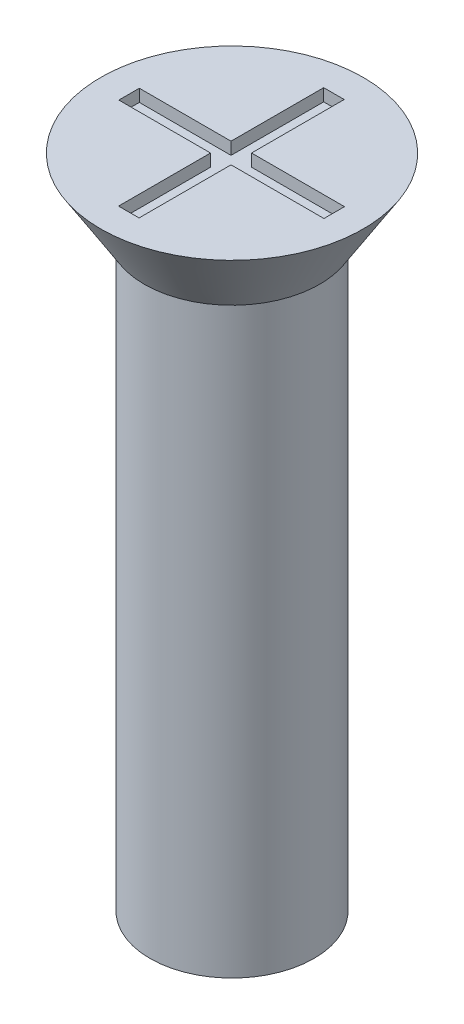
ISO-10303-21;
HEADER;
FILE_DESCRIPTION(('STEP AP214'),'2;1');
FILE_NAME('part.step','',(''),(''),'','','');
FILE_SCHEMA(('AUTOMOTIVE_DESIGN { 1 0 10303 214 1 1 1 1 }'));
ENDSEC;
DATA;
#1=APPLICATION_CONTEXT('core data for automotive mechanical design processes');
#2=APPLICATION_PROTOCOL_DEFINITION('international standard','automotive_design',2000,#1);
#3=PRODUCT_CONTEXT('',#1,'mechanical');
#4=PRODUCT('Part','Part','',(#3));
#5=PRODUCT_RELATED_PRODUCT_CATEGORY('part','',(#4));
#6=PRODUCT_DEFINITION_FORMATION('','',#4);
#7=PRODUCT_DEFINITION_CONTEXT('part definition',#1,'design');
#8=PRODUCT_DEFINITION('design','',#6,#7);
#9=PRODUCT_DEFINITION_SHAPE('','',#8);
#10=(LENGTH_UNIT() NAMED_UNIT(*) SI_UNIT(.MILLI.,.METRE.));
#11=(NAMED_UNIT(*) PLANE_ANGLE_UNIT() SI_UNIT($,.RADIAN.));
#12=(NAMED_UNIT(*) SI_UNIT($,.STERADIAN.) SOLID_ANGLE_UNIT());
#13=UNCERTAINTY_MEASURE_WITH_UNIT(LENGTH_MEASURE(1.E-05),#10,'distance_accuracy_value','');
#14=(GEOMETRIC_REPRESENTATION_CONTEXT(3) GLOBAL_UNCERTAINTY_ASSIGNED_CONTEXT((#13)) GLOBAL_UNIT_ASSIGNED_CONTEXT((#10,
#11,#12)) REPRESENTATION_CONTEXT('',''));
#15=CARTESIAN_POINT('',(0.,0.,0.));
#16=DIRECTION('',(0.,0.,1.));
#17=DIRECTION('',(1.,0.,0.));
#18=AXIS2_PLACEMENT_3D('',#15,#16,#17);
#19=CARTESIAN_POINT('',(0.,16.,0.));
#20=DIRECTION('',(0.,1.,0.));
#21=DIRECTION('',(0.,0.,1.));
#22=AXIS2_PLACEMENT_3D('',#19,#20,#21);
#23=PLANE('',#22);
#24=CARTESIAN_POINT('',(0.,16.,0.));
#25=DIRECTION('',(0.,1.,0.));
#26=DIRECTION('',(0.,0.,1.));
#27=AXIS2_PLACEMENT_3D('',#24,#25,#26);
#28=CIRCLE('',#27,3.2);
#29=CARTESIAN_POINT('',(0.,16.,3.2));
#30=VERTEX_POINT('',#29);
#31=EDGE_CURVE('E192',#30,#30,#28,.T.);
#32=ORIENTED_EDGE('',*,*,#31,.T.);
#33=EDGE_LOOP('',(#32));
#34=FACE_BOUND('',#33,.T.);
#35=DIRECTION('',(1.,0.,0.));
#36=VECTOR('',#35,1.);
#37=CARTESIAN_POINT('',(0.,16.,-2.5));
#38=LINE('',#37,#36);
#39=CARTESIAN_POINT('',(-0.265272843023468,16.,-2.5));
#40=VERTEX_POINT('',#39);
#41=CARTESIAN_POINT('',(0.234727156976532,16.,-2.5));
#42=VERTEX_POINT('',#41);
#43=EDGE_CURVE('E161',#40,#42,#38,.T.);
#44=ORIENTED_EDGE('',*,*,#43,.T.);
#45=DIRECTION('',(0.,0.,1.));
#46=VECTOR('',#45,1.);
#47=CARTESIAN_POINT('',(0.234727156976532,16.,0.));
#48=LINE('',#47,#46);
#49=CARTESIAN_POINT('',(0.234727156976532,16.,-0.241621514992573));
#50=VERTEX_POINT('',#49);
#51=EDGE_CURVE('E48',#42,#50,#48,.T.);
#52=ORIENTED_EDGE('',*,*,#51,.T.);
#53=DIRECTION('',(1.,0.,0.));
#54=VECTOR('',#53,1.);
#55=CARTESIAN_POINT('',(0.,16.,-0.241621514992573));
#56=LINE('',#55,#54);
#57=CARTESIAN_POINT('',(2.5,16.,-0.241621514992573));
#58=VERTEX_POINT('',#57);
#59=EDGE_CURVE('E98',#50,#58,#56,.T.);
#60=ORIENTED_EDGE('',*,*,#59,.T.);
#61=DIRECTION('',(0.,0.,1.));
#62=VECTOR('',#61,1.);
#63=CARTESIAN_POINT('',(2.5,16.,0.));
#64=LINE('',#63,#62);
#65=CARTESIAN_POINT('',(2.5,16.,0.258378485007427));
#66=VERTEX_POINT('',#65);
#67=EDGE_CURVE('E186',#58,#66,#64,.T.);
#68=ORIENTED_EDGE('',*,*,#67,.T.);
#69=DIRECTION('',(1.,0.,0.));
#70=VECTOR('',#69,1.);
#71=CARTESIAN_POINT('',(0.,16.,0.258378485007427));
#72=LINE('',#71,#70);
#73=CARTESIAN_POINT('',(0.234727156976532,16.,0.258378485007427));
#74=VERTEX_POINT('',#73);
#75=EDGE_CURVE('E145',#74,#66,#72,.T.);
#76=ORIENTED_EDGE('',*,*,#75,.F.);
#77=DIRECTION('',(0.,0.,1.));
#78=VECTOR('',#77,1.);
#79=CARTESIAN_POINT('',(0.234727156976532,16.,0.));
#80=LINE('',#79,#78);
#81=CARTESIAN_POINT('',(0.234727156976533,16.,2.5));
#82=VERTEX_POINT('',#81);
#83=EDGE_CURVE('E182',#74,#82,#80,.T.);
#84=ORIENTED_EDGE('',*,*,#83,.T.);
#85=DIRECTION('',(1.,0.,0.));
#86=VECTOR('',#85,1.);
#87=CARTESIAN_POINT('',(0.,16.,2.5));
#88=LINE('',#87,#86);
#89=CARTESIAN_POINT('',(-0.265272843023467,16.,2.5));
#90=VERTEX_POINT('',#89);
#91=EDGE_CURVE('E179',#90,#82,#88,.T.);
#92=ORIENTED_EDGE('',*,*,#91,.F.);
#93=DIRECTION('',(0.,0.,1.));
#94=VECTOR('',#93,1.);
#95=CARTESIAN_POINT('',(-0.265272843023468,16.,0.));
#96=LINE('',#95,#94);
#97=CARTESIAN_POINT('',(-0.265272843023468,16.,0.258378485007427));
#98=VERTEX_POINT('',#97);
#99=EDGE_CURVE('E176',#98,#90,#96,.T.);
#100=ORIENTED_EDGE('',*,*,#99,.F.);
#101=DIRECTION('',(1.,0.,0.));
#102=VECTOR('',#101,1.);
#103=CARTESIAN_POINT('',(0.,16.,0.258378485007427));
#104=LINE('',#103,#102);
#105=CARTESIAN_POINT('',(-2.5,16.,0.258378485007427));
#106=VERTEX_POINT('',#105);
#107=EDGE_CURVE('E173',#106,#98,#104,.T.);
#108=ORIENTED_EDGE('',*,*,#107,.F.);
#109=DIRECTION('',(0.,0.,1.));
#110=VECTOR('',#109,1.);
#111=CARTESIAN_POINT('',(-2.5,16.,0.));
#112=LINE('',#111,#110);
#113=CARTESIAN_POINT('',(-2.5,16.,-0.241621514992573));
#114=VERTEX_POINT('',#113);
#115=EDGE_CURVE('E170',#114,#106,#112,.T.);
#116=ORIENTED_EDGE('',*,*,#115,.F.);
#117=DIRECTION('',(1.,0.,0.));
#118=VECTOR('',#117,1.);
#119=CARTESIAN_POINT('',(0.,16.,-0.241621514992573));
#120=LINE('',#119,#118);
#121=CARTESIAN_POINT('',(-0.265272843023468,16.,-0.241621514992573));
#122=VERTEX_POINT('',#121);
#123=EDGE_CURVE('E167',#114,#122,#120,.T.);
#124=ORIENTED_EDGE('',*,*,#123,.T.);
#125=DIRECTION('',(0.,0.,1.));
#126=VECTOR('',#125,1.);
#127=CARTESIAN_POINT('',(-0.265272843023468,16.,0.));
#128=LINE('',#127,#126);
#129=EDGE_CURVE('E164',#40,#122,#128,.T.);
#130=ORIENTED_EDGE('',*,*,#129,.F.);
#131=EDGE_LOOP('',(#44,#52,#60,#68,#76,#84,#92,#100,#108,#116,#124,#130));
#132=FACE_BOUND('',#131,.T.);
#133=ADVANCED_FACE('F33',(#34,#132),#23,.T.);
#134=CARTESIAN_POINT('',(0.,16.,0.));
#135=DIRECTION('',(0.,-1.,0.));
#136=DIRECTION('',(0.,0.,-1.));
#137=AXIS2_PLACEMENT_3D('',#134,#135,#136);
#138=CYLINDRICAL_SURFACE('',#137,2.);
#139=CARTESIAN_POINT('',(0.,0.,0.));
#140=DIRECTION('',(0.,1.,0.));
#141=DIRECTION('',(0.,0.,1.));
#142=AXIS2_PLACEMENT_3D('',#139,#140,#141);
#143=CIRCLE('',#142,2.);
#144=CARTESIAN_POINT('',(0.,0.,2.));
#145=VERTEX_POINT('',#144);
#146=EDGE_CURVE('E41',#145,#145,#143,.T.);
#147=ORIENTED_EDGE('',*,*,#146,.T.);
#148=EDGE_LOOP('',(#147));
#149=FACE_BOUND('',#148,.T.);
#150=CARTESIAN_POINT('',(0.,14.3,0.));
#151=DIRECTION('',(0.,1.,0.));
#152=DIRECTION('',(0.,0.,1.));
#153=AXIS2_PLACEMENT_3D('',#150,#151,#152);
#154=CIRCLE('',#153,2.);
#155=CARTESIAN_POINT('',(0.,14.3,2.));
#156=VERTEX_POINT('',#155);
#157=EDGE_CURVE('E11',#156,#156,#154,.T.);
#158=ORIENTED_EDGE('',*,*,#157,.F.);
#159=EDGE_LOOP('',(#158));
#160=FACE_BOUND('',#159,.T.);
#161=ADVANCED_FACE('F35',(#149,#160),#138,.T.);
#162=CARTESIAN_POINT('',(0.,0.,0.));
#163=DIRECTION('',(0.,1.,0.));
#164=DIRECTION('',(0.,0.,1.));
#165=AXIS2_PLACEMENT_3D('',#162,#163,#164);
#166=PLANE('',#165);
#167=ORIENTED_EDGE('',*,*,#146,.F.);
#168=EDGE_LOOP('',(#167));
#169=FACE_BOUND('',#168,.T.);
#170=ADVANCED_FACE('F219',(#169),#166,.F.);
#171=CARTESIAN_POINT('',(0.,16.,0.));
#172=DIRECTION('',(0.,1.,0.));
#173=DIRECTION('',(0.,0.,1.));
#174=AXIS2_PLACEMENT_3D('',#171,#172,#173);
#175=CONICAL_SURFACE('',#174,3.2,0.558505360638187);
#176=CARTESIAN_POINT('',(0.,14.3,0.));
#177=DIRECTION('',(0.,1.,0.));
#178=DIRECTION('',(0.,0.,1.));
#179=AXIS2_PLACEMENT_3D('',#176,#177,#178);
#180=CIRCLE('',#179,2.13772210175414);
#181=CARTESIAN_POINT('',(0.,14.3,2.13772210175414));
#182=VERTEX_POINT('',#181);
#183=EDGE_CURVE('E212',#182,#182,#180,.T.);
#184=ORIENTED_EDGE('',*,*,#183,.T.);
#185=EDGE_LOOP('',(#184));
#186=FACE_BOUND('',#185,.T.);
#187=ORIENTED_EDGE('',*,*,#31,.F.);
#188=EDGE_LOOP('',(#187));
#189=FACE_BOUND('',#188,.T.);
#190=ADVANCED_FACE('F221',(#186,#189),#175,.T.);
#191=CARTESIAN_POINT('',(0.,14.3,0.));
#192=DIRECTION('',(0.,1.,0.));
#193=DIRECTION('',(0.,0.,1.));
#194=AXIS2_PLACEMENT_3D('',#191,#192,#193);
#195=PLANE('',#194);
#196=ORIENTED_EDGE('',*,*,#157,.T.);
#197=EDGE_LOOP('',(#196));
#198=FACE_BOUND('',#197,.T.);
#199=ORIENTED_EDGE('',*,*,#183,.F.);
#200=EDGE_LOOP('',(#199));
#201=FACE_BOUND('',#200,.T.);
#202=ADVANCED_FACE('F226',(#198,#201),#195,.F.);
#203=CARTESIAN_POINT('',(0.234727156976532,15.7,0.));
#204=DIRECTION('',(-1.,0.,0.));
#205=DIRECTION('',(0.,0.,1.));
#206=AXIS2_PLACEMENT_3D('',#203,#204,#205);
#207=PLANE('',#206);
#208=ORIENTED_EDGE('',*,*,#51,.F.);
#209=DIRECTION('',(0.,1.,0.));
#210=VECTOR('',#209,1.);
#211=CARTESIAN_POINT('',(0.234727156976532,15.7,-2.5));
#212=LINE('',#211,#210);
#213=CARTESIAN_POINT('',(0.234727156976532,15.7,-2.5));
#214=VERTEX_POINT('',#213);
#215=EDGE_CURVE('E159',#214,#42,#212,.T.);
#216=ORIENTED_EDGE('',*,*,#215,.F.);
#217=DIRECTION('',(0.,0.,1.));
#218=VECTOR('',#217,1.);
#219=CARTESIAN_POINT('',(0.234727156976532,15.7,0.));
#220=LINE('',#219,#218);
#221=CARTESIAN_POINT('',(0.234727156976532,15.7,-0.241621514992573));
#222=VERTEX_POINT('',#221);
#223=EDGE_CURVE('E189',#214,#222,#220,.T.);
#224=ORIENTED_EDGE('',*,*,#223,.T.);
#225=DIRECTION('',(0.,1.,0.));
#226=VECTOR('',#225,1.);
#227=CARTESIAN_POINT('',(0.234727156976532,15.7,-0.241621514992573));
#228=LINE('',#227,#226);
#229=EDGE_CURVE('E190',#222,#50,#228,.T.);
#230=ORIENTED_EDGE('',*,*,#229,.T.);
#231=EDGE_LOOP('',(#208,#216,#224,#230));
#232=FACE_BOUND('',#231,.T.);
#233=ADVANCED_FACE('F238',(#232),#207,.T.);
#234=CARTESIAN_POINT('',(0.,15.7,-0.241621514992573));
#235=DIRECTION('',(0.,0.,1.));
#236=DIRECTION('',(1.,0.,0.));
#237=AXIS2_PLACEMENT_3D('',#234,#235,#236);
#238=PLANE('',#237);
#239=ORIENTED_EDGE('',*,*,#59,.F.);
#240=ORIENTED_EDGE('',*,*,#229,.F.);
#241=DIRECTION('',(1.,0.,0.));
#242=VECTOR('',#241,1.);
#243=CARTESIAN_POINT('',(0.,15.7,-0.241621514992573));
#244=LINE('',#243,#242);
#245=CARTESIAN_POINT('',(2.5,15.7,-0.241621514992573));
#246=VERTEX_POINT('',#245);
#247=EDGE_CURVE('E57',#222,#246,#244,.T.);
#248=ORIENTED_EDGE('',*,*,#247,.T.);
#249=DIRECTION('',(0.,1.,0.));
#250=VECTOR('',#249,1.);
#251=CARTESIAN_POINT('',(2.5,15.7,-0.241621514992573));
#252=LINE('',#251,#250);
#253=EDGE_CURVE('E137',#246,#58,#252,.T.);
#254=ORIENTED_EDGE('',*,*,#253,.T.);
#255=EDGE_LOOP('',(#239,#240,#248,#254));
#256=FACE_BOUND('',#255,.T.);
#257=ADVANCED_FACE('F242',(#256),#238,.T.);
#258=CARTESIAN_POINT('',(2.5,15.7,0.));
#259=DIRECTION('',(-1.,0.,0.));
#260=DIRECTION('',(0.,0.,1.));
#261=AXIS2_PLACEMENT_3D('',#258,#259,#260);
#262=PLANE('',#261);
#263=ORIENTED_EDGE('',*,*,#67,.F.);
#264=ORIENTED_EDGE('',*,*,#253,.F.);
#265=DIRECTION('',(0.,0.,1.));
#266=VECTOR('',#265,1.);
#267=CARTESIAN_POINT('',(2.5,15.7,0.));
#268=LINE('',#267,#266);
#269=CARTESIAN_POINT('',(2.5,15.7,0.258378485007427));
#270=VERTEX_POINT('',#269);
#271=EDGE_CURVE('E131',#246,#270,#268,.T.);
#272=ORIENTED_EDGE('',*,*,#271,.T.);
#273=DIRECTION('',(0.,1.,0.));
#274=VECTOR('',#273,1.);
#275=CARTESIAN_POINT('',(2.5,15.7,0.258378485007427));
#276=LINE('',#275,#274);
#277=EDGE_CURVE('E135',#270,#66,#276,.T.);
#278=ORIENTED_EDGE('',*,*,#277,.T.);
#279=EDGE_LOOP('',(#263,#264,#272,#278));
#280=FACE_BOUND('',#279,.T.);
#281=ADVANCED_FACE('F134',(#280),#262,.T.);
#282=CARTESIAN_POINT('',(0.,15.7,0.258378485007427));
#283=DIRECTION('',(0.,0.,1.));
#284=DIRECTION('',(1.,0.,0.));
#285=AXIS2_PLACEMENT_3D('',#282,#283,#284);
#286=PLANE('',#285);
#287=ORIENTED_EDGE('',*,*,#75,.T.);
#288=ORIENTED_EDGE('',*,*,#277,.F.);
#289=DIRECTION('',(1.,0.,0.));
#290=VECTOR('',#289,1.);
#291=CARTESIAN_POINT('',(0.,15.7,0.258378485007427));
#292=LINE('',#291,#290);
#293=CARTESIAN_POINT('',(0.234727156976532,15.7,0.258378485007427));
#294=VERTEX_POINT('',#293);
#295=EDGE_CURVE('E139',#294,#270,#292,.T.);
#296=ORIENTED_EDGE('',*,*,#295,.F.);
#297=DIRECTION('',(0.,1.,0.));
#298=VECTOR('',#297,1.);
#299=CARTESIAN_POINT('',(0.234727156976532,15.7,0.258378485007427));
#300=LINE('',#299,#298);
#301=EDGE_CURVE('E147',#294,#74,#300,.T.);
#302=ORIENTED_EDGE('',*,*,#301,.T.);
#303=EDGE_LOOP('',(#287,#288,#296,#302));
#304=FACE_BOUND('',#303,.T.);
#305=ADVANCED_FACE('F143',(#304),#286,.F.);
#306=CARTESIAN_POINT('',(0.234727156976532,15.7,0.));
#307=DIRECTION('',(-1.,0.,0.));
#308=DIRECTION('',(0.,0.,1.));
#309=AXIS2_PLACEMENT_3D('',#306,#307,#308);
#310=PLANE('',#309);
#311=ORIENTED_EDGE('',*,*,#83,.F.);
#312=ORIENTED_EDGE('',*,*,#301,.F.);
#313=DIRECTION('',(0.,0.,1.));
#314=VECTOR('',#313,1.);
#315=CARTESIAN_POINT('',(0.234727156976532,15.7,0.));
#316=LINE('',#315,#314);
#317=CARTESIAN_POINT('',(0.234727156976533,15.7,2.5));
#318=VERTEX_POINT('',#317);
#319=EDGE_CURVE('E152',#294,#318,#316,.T.);
#320=ORIENTED_EDGE('',*,*,#319,.T.);
#321=DIRECTION('',(0.,1.,0.));
#322=VECTOR('',#321,1.);
#323=CARTESIAN_POINT('',(0.234727156976533,15.7,2.5));
#324=LINE('',#323,#322);
#325=EDGE_CURVE('E195',#318,#82,#324,.T.);
#326=ORIENTED_EDGE('',*,*,#325,.T.);
#327=EDGE_LOOP('',(#311,#312,#320,#326));
#328=FACE_BOUND('',#327,.T.);
#329=ADVANCED_FACE('F269',(#328),#310,.T.);
#330=CARTESIAN_POINT('',(0.,15.7,2.5));
#331=DIRECTION('',(0.,0.,1.));
#332=DIRECTION('',(1.,0.,0.));
#333=AXIS2_PLACEMENT_3D('',#330,#331,#332);
#334=PLANE('',#333);
#335=ORIENTED_EDGE('',*,*,#91,.T.);
#336=ORIENTED_EDGE('',*,*,#325,.F.);
#337=DIRECTION('',(1.,0.,0.));
#338=VECTOR('',#337,1.);
#339=CARTESIAN_POINT('',(0.,15.7,2.5));
#340=LINE('',#339,#338);
#341=CARTESIAN_POINT('',(-0.265272843023467,15.7,2.5));
#342=VERTEX_POINT('',#341);
#343=EDGE_CURVE('E154',#342,#318,#340,.T.);
#344=ORIENTED_EDGE('',*,*,#343,.F.);
#345=DIRECTION('',(0.,1.,0.));
#346=VECTOR('',#345,1.);
#347=CARTESIAN_POINT('',(-0.265272843023467,15.7,2.5));
#348=LINE('',#347,#346);
#349=EDGE_CURVE('E197',#342,#90,#348,.T.);
#350=ORIENTED_EDGE('',*,*,#349,.T.);
#351=EDGE_LOOP('',(#335,#336,#344,#350));
#352=FACE_BOUND('',#351,.T.);
#353=ADVANCED_FACE('F265',(#352),#334,.F.);
#354=CARTESIAN_POINT('',(-0.265272843023468,15.7,0.));
#355=DIRECTION('',(-1.,0.,0.));
#356=DIRECTION('',(0.,0.,1.));
#357=AXIS2_PLACEMENT_3D('',#354,#355,#356);
#358=PLANE('',#357);
#359=ORIENTED_EDGE('',*,*,#99,.T.);
#360=ORIENTED_EDGE('',*,*,#349,.F.);
#361=DIRECTION('',(0.,0.,1.));
#362=VECTOR('',#361,1.);
#363=CARTESIAN_POINT('',(-0.265272843023468,15.7,0.));
#364=LINE('',#363,#362);
#365=CARTESIAN_POINT('',(-0.265272843023468,15.7,0.258378485007427));
#366=VERTEX_POINT('',#365);
#367=EDGE_CURVE('E417',#366,#342,#364,.T.);
#368=ORIENTED_EDGE('',*,*,#367,.F.);
#369=DIRECTION('',(0.,1.,0.));
#370=VECTOR('',#369,1.);
#371=CARTESIAN_POINT('',(-0.265272843023468,15.7,0.258378485007427));
#372=LINE('',#371,#370);
#373=EDGE_CURVE('E199',#366,#98,#372,.T.);
#374=ORIENTED_EDGE('',*,*,#373,.T.);
#375=EDGE_LOOP('',(#359,#360,#368,#374));
#376=FACE_BOUND('',#375,.T.);
#377=ADVANCED_FACE('F261',(#376),#358,.F.);
#378=CARTESIAN_POINT('',(0.,15.7,0.258378485007427));
#379=DIRECTION('',(0.,0.,1.));
#380=DIRECTION('',(1.,0.,0.));
#381=AXIS2_PLACEMENT_3D('',#378,#379,#380);
#382=PLANE('',#381);
#383=ORIENTED_EDGE('',*,*,#107,.T.);
#384=ORIENTED_EDGE('',*,*,#373,.F.);
#385=DIRECTION('',(1.,0.,0.));
#386=VECTOR('',#385,1.);
#387=CARTESIAN_POINT('',(0.,15.7,0.258378485007427));
#388=LINE('',#387,#386);
#389=CARTESIAN_POINT('',(-2.5,15.7,0.258378485007427));
#390=VERTEX_POINT('',#389);
#391=EDGE_CURVE('E414',#390,#366,#388,.T.);
#392=ORIENTED_EDGE('',*,*,#391,.F.);
#393=DIRECTION('',(0.,1.,0.));
#394=VECTOR('',#393,1.);
#395=CARTESIAN_POINT('',(-2.5,15.7,0.258378485007427));
#396=LINE('',#395,#394);
#397=EDGE_CURVE('E201',#390,#106,#396,.T.);
#398=ORIENTED_EDGE('',*,*,#397,.T.);
#399=EDGE_LOOP('',(#383,#384,#392,#398));
#400=FACE_BOUND('',#399,.T.);
#401=ADVANCED_FACE('F257',(#400),#382,.F.);
#402=CARTESIAN_POINT('',(-2.5,15.7,0.));
#403=DIRECTION('',(-1.,0.,0.));
#404=DIRECTION('',(0.,0.,1.));
#405=AXIS2_PLACEMENT_3D('',#402,#403,#404);
#406=PLANE('',#405);
#407=ORIENTED_EDGE('',*,*,#115,.T.);
#408=ORIENTED_EDGE('',*,*,#397,.F.);
#409=DIRECTION('',(0.,0.,1.));
#410=VECTOR('',#409,1.);
#411=CARTESIAN_POINT('',(-2.5,15.7,0.));
#412=LINE('',#411,#410);
#413=CARTESIAN_POINT('',(-2.5,15.7,-0.241621514992573));
#414=VERTEX_POINT('',#413);
#415=EDGE_CURVE('E411',#414,#390,#412,.T.);
#416=ORIENTED_EDGE('',*,*,#415,.F.);
#417=DIRECTION('',(0.,1.,0.));
#418=VECTOR('',#417,1.);
#419=CARTESIAN_POINT('',(-2.5,15.7,-0.241621514992573));
#420=LINE('',#419,#418);
#421=EDGE_CURVE('E203',#414,#114,#420,.T.);
#422=ORIENTED_EDGE('',*,*,#421,.T.);
#423=EDGE_LOOP('',(#407,#408,#416,#422));
#424=FACE_BOUND('',#423,.T.);
#425=ADVANCED_FACE('F253',(#424),#406,.F.);
#426=CARTESIAN_POINT('',(0.,15.7,-0.241621514992573));
#427=DIRECTION('',(0.,0.,1.));
#428=DIRECTION('',(1.,0.,0.));
#429=AXIS2_PLACEMENT_3D('',#426,#427,#428);
#430=PLANE('',#429);
#431=ORIENTED_EDGE('',*,*,#123,.F.);
#432=ORIENTED_EDGE('',*,*,#421,.F.);
#433=DIRECTION('',(1.,0.,0.));
#434=VECTOR('',#433,1.);
#435=CARTESIAN_POINT('',(0.,15.7,-0.241621514992573));
#436=LINE('',#435,#434);
#437=CARTESIAN_POINT('',(-0.265272843023468,15.7,-0.241621514992573));
#438=VERTEX_POINT('',#437);
#439=EDGE_CURVE('E409',#414,#438,#436,.T.);
#440=ORIENTED_EDGE('',*,*,#439,.T.);
#441=DIRECTION('',(0.,1.,0.));
#442=VECTOR('',#441,1.);
#443=CARTESIAN_POINT('',(-0.265272843023468,15.7,-0.241621514992573));
#444=LINE('',#443,#442);
#445=EDGE_CURVE('E205',#438,#122,#444,.T.);
#446=ORIENTED_EDGE('',*,*,#445,.T.);
#447=EDGE_LOOP('',(#431,#432,#440,#446));
#448=FACE_BOUND('',#447,.T.);
#449=ADVANCED_FACE('F249',(#448),#430,.T.);
#450=CARTESIAN_POINT('',(-0.265272843023468,15.7,0.));
#451=DIRECTION('',(-1.,0.,0.));
#452=DIRECTION('',(0.,0.,1.));
#453=AXIS2_PLACEMENT_3D('',#450,#451,#452);
#454=PLANE('',#453);
#455=ORIENTED_EDGE('',*,*,#129,.T.);
#456=ORIENTED_EDGE('',*,*,#445,.F.);
#457=DIRECTION('',(0.,0.,1.));
#458=VECTOR('',#457,1.);
#459=CARTESIAN_POINT('',(-0.265272843023468,15.7,0.));
#460=LINE('',#459,#458);
#461=CARTESIAN_POINT('',(-0.265272843023468,15.7,-2.5));
#462=VERTEX_POINT('',#461);
#463=EDGE_CURVE('E405',#462,#438,#460,.T.);
#464=ORIENTED_EDGE('',*,*,#463,.F.);
#465=DIRECTION('',(0.,1.,0.));
#466=VECTOR('',#465,1.);
#467=CARTESIAN_POINT('',(-0.265272843023468,15.7,-2.5));
#468=LINE('',#467,#466);
#469=EDGE_CURVE('E207',#462,#40,#468,.T.);
#470=ORIENTED_EDGE('',*,*,#469,.T.);
#471=EDGE_LOOP('',(#455,#456,#464,#470));
#472=FACE_BOUND('',#471,.T.);
#473=ADVANCED_FACE('F246',(#472),#454,.F.);
#474=CARTESIAN_POINT('',(0.,15.7,-2.5));
#475=DIRECTION('',(0.,0.,1.));
#476=DIRECTION('',(1.,0.,0.));
#477=AXIS2_PLACEMENT_3D('',#474,#475,#476);
#478=PLANE('',#477);
#479=ORIENTED_EDGE('',*,*,#43,.F.);
#480=ORIENTED_EDGE('',*,*,#469,.F.);
#481=DIRECTION('',(1.,0.,0.));
#482=VECTOR('',#481,1.);
#483=CARTESIAN_POINT('',(0.,15.7,-2.5));
#484=LINE('',#483,#482);
#485=EDGE_CURVE('E105',#462,#214,#484,.T.);
#486=ORIENTED_EDGE('',*,*,#485,.T.);
#487=ORIENTED_EDGE('',*,*,#215,.T.);
#488=EDGE_LOOP('',(#479,#480,#486,#487));
#489=FACE_BOUND('',#488,.T.);
#490=ADVANCED_FACE('F243',(#489),#478,.T.);
#491=CARTESIAN_POINT('',(0.,15.7,0.));
#492=DIRECTION('',(0.,1.,0.));
#493=DIRECTION('',(0.,0.,1.));
#494=AXIS2_PLACEMENT_3D('',#491,#492,#493);
#495=PLANE('',#494);
#496=ORIENTED_EDGE('',*,*,#223,.F.);
#497=ORIENTED_EDGE('',*,*,#485,.F.);
#498=ORIENTED_EDGE('',*,*,#463,.T.);
#499=ORIENTED_EDGE('',*,*,#439,.F.);
#500=ORIENTED_EDGE('',*,*,#415,.T.);
#501=ORIENTED_EDGE('',*,*,#391,.T.);
#502=ORIENTED_EDGE('',*,*,#367,.T.);
#503=ORIENTED_EDGE('',*,*,#343,.T.);
#504=ORIENTED_EDGE('',*,*,#319,.F.);
#505=ORIENTED_EDGE('',*,*,#295,.T.);
#506=ORIENTED_EDGE('',*,*,#271,.F.);
#507=ORIENTED_EDGE('',*,*,#247,.F.);
#508=EDGE_LOOP('',(#496,#497,#498,#499,#500,#501,#502,#503,#504,#505,#506,#507));
#509=FACE_BOUND('',#508,.T.);
#510=ADVANCED_FACE('F150',(#509),#495,.T.);
#511=CLOSED_SHELL('',(#133,#161,#170,#190,#202,#233,#257,#281,#305,#329,#353,#377,#401,#425,
#449,#473,#490,#510));
#512=MANIFOLD_SOLID_BREP('B2',#511);
#513=ADVANCED_BREP_SHAPE_REPRESENTATION('',(#18,#512),#14);
#514=SHAPE_DEFINITION_REPRESENTATION(#9,#513);
ENDSEC;
END-ISO-10303-21;
